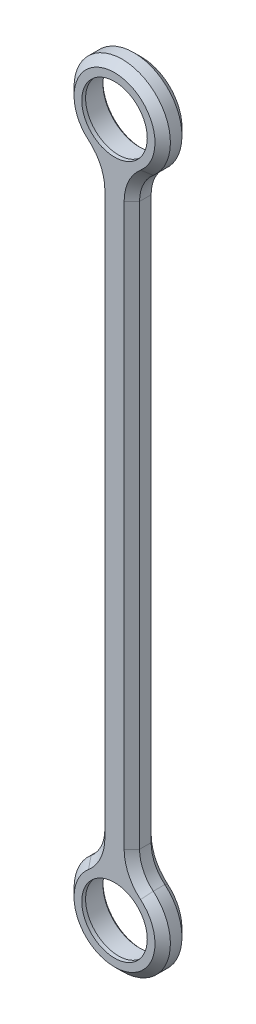
ISO-10303-21;
HEADER;
FILE_DESCRIPTION(('STEP AP214'),'2;1');
FILE_NAME('part.step','',(''),(''),'','','');
FILE_SCHEMA(('AUTOMOTIVE_DESIGN { 1 0 10303 214 1 1 1 1 }'));
ENDSEC;
DATA;
#1=APPLICATION_CONTEXT('core data for automotive mechanical design processes');
#2=APPLICATION_PROTOCOL_DEFINITION('international standard','automotive_design',2000,#1);
#3=PRODUCT_CONTEXT('',#1,'mechanical');
#4=PRODUCT('Part','Part','',(#3));
#5=PRODUCT_RELATED_PRODUCT_CATEGORY('part','',(#4));
#6=PRODUCT_DEFINITION_FORMATION('','',#4);
#7=PRODUCT_DEFINITION_CONTEXT('part definition',#1,'design');
#8=PRODUCT_DEFINITION('design','',#6,#7);
#9=PRODUCT_DEFINITION_SHAPE('','',#8);
#10=(LENGTH_UNIT() NAMED_UNIT(*) SI_UNIT(.MILLI.,.METRE.));
#11=(NAMED_UNIT(*) PLANE_ANGLE_UNIT() SI_UNIT($,.RADIAN.));
#12=(NAMED_UNIT(*) SI_UNIT($,.STERADIAN.) SOLID_ANGLE_UNIT());
#13=UNCERTAINTY_MEASURE_WITH_UNIT(LENGTH_MEASURE(1.E-05),#10,'distance_accuracy_value','');
#14=(GEOMETRIC_REPRESENTATION_CONTEXT(3) GLOBAL_UNCERTAINTY_ASSIGNED_CONTEXT((#13)) GLOBAL_UNIT_ASSIGNED_CONTEXT((#10,
#11,#12)) REPRESENTATION_CONTEXT('',''));
#15=CARTESIAN_POINT('',(0.,0.,0.));
#16=DIRECTION('',(0.,0.,1.));
#17=DIRECTION('',(1.,0.,0.));
#18=AXIS2_PLACEMENT_3D('',#15,#16,#17);
#19=CARTESIAN_POINT('',(44.5,-198.919368030824,-215.018764280739));
#20=DIRECTION('',(-1.,0.,0.));
#21=DIRECTION('',(0.,-1.,0.));
#22=AXIS2_PLACEMENT_3D('',#19,#20,#21);
#23=PLANE('',#22);
#24=DIRECTION('',(0.,0.,-1.));
#25=VECTOR('',#24,1.);
#26=CARTESIAN_POINT('',(44.5,-45.204650534086,-2.50000000010994));
#27=LINE('',#26,#25);
#28=CARTESIAN_POINT('',(44.5,-45.204650534086,-6.50000000010979));
#29=VERTEX_POINT('',#28);
#30=CARTESIAN_POINT('',(44.5,-45.204650534086,-3.5000000001108));
#31=VERTEX_POINT('',#30);
#32=EDGE_CURVE('E393',#29,#31,#27,.F.);
#33=ORIENTED_EDGE('',*,*,#32,.T.);
#34=DIRECTION('',(0.,-1.,0.));
#35=VECTOR('',#34,1.);
#36=CARTESIAN_POINT('',(44.5,-190.795349465914,-3.5000000001108));
#37=LINE('',#36,#35);
#38=CARTESIAN_POINT('',(44.5,-190.795349465914,-3.5000000001108));
#39=VERTEX_POINT('',#38);
#40=EDGE_CURVE('E295',#31,#39,#37,.T.);
#41=ORIENTED_EDGE('',*,*,#40,.T.);
#42=DIRECTION('',(0.,0.,-1.));
#43=VECTOR('',#42,1.);
#44=CARTESIAN_POINT('',(44.5,-190.795349465914,-8.50000000010665));
#45=LINE('',#44,#43);
#46=CARTESIAN_POINT('',(44.5,-190.795349465914,-6.50000000010673));
#47=VERTEX_POINT('',#46);
#48=EDGE_CURVE('E198',#39,#47,#45,.T.);
#49=ORIENTED_EDGE('',*,*,#48,.T.);
#50=DIRECTION('',(0.,1.,0.));
#51=VECTOR('',#50,1.);
#52=CARTESIAN_POINT('',(44.5,-198.919368030819,-6.50000000010656));
#53=LINE('',#52,#51);
#54=EDGE_CURVE('E242',#47,#29,#53,.T.);
#55=ORIENTED_EDGE('',*,*,#54,.T.);
#56=EDGE_LOOP('',(#33,#41,#49,#55));
#57=FACE_BOUND('',#56,.T.);
#58=ADVANCED_FACE('F40',(#57),#23,.F.);
#59=CARTESIAN_POINT('',(40.,-207.999999999999,-215.018764280738));
#60=DIRECTION('',(0.,0.,1.));
#61=DIRECTION('',(1.,0.,0.));
#62=AXIS2_PLACEMENT_3D('',#59,#60,#61);
#63=CYLINDRICAL_SURFACE('',#62,12.5);
#64=DIRECTION('',(0.,0.,1.));
#65=VECTOR('',#64,1.);
#66=CARTESIAN_POINT('',(48.0555555555556,-198.441860814396,-215.018764280738));
#67=LINE('',#66,#65);
#68=CARTESIAN_POINT('',(48.0555555555556,-198.441860814396,-6.50000000010673));
#69=VERTEX_POINT('',#68);
#70=CARTESIAN_POINT('',(48.0555555555556,-198.441860814396,-3.5000000001108));
#71=VERTEX_POINT('',#70);
#72=EDGE_CURVE('E384',#69,#71,#67,.T.);
#73=ORIENTED_EDGE('',*,*,#72,.T.);
#74=CARTESIAN_POINT('',(40.,-207.999999999999,-3.5000000001108));
#75=DIRECTION('',(0.,0.,1.));
#76=DIRECTION('',(1.,0.,0.));
#77=AXIS2_PLACEMENT_3D('',#74,#75,#76);
#78=CIRCLE('',#77,12.5);
#79=CARTESIAN_POINT('',(31.9444444444445,-198.441860814396,-3.5000000001108));
#80=VERTEX_POINT('',#79);
#81=EDGE_CURVE('E308',#71,#80,#78,.F.);
#82=ORIENTED_EDGE('',*,*,#81,.T.);
#83=DIRECTION('',(0.,0.,1.));
#84=VECTOR('',#83,1.);
#85=CARTESIAN_POINT('',(31.9444444444445,-198.441860814396,-215.018764280738));
#86=LINE('',#85,#84);
#87=CARTESIAN_POINT('',(31.9444444444445,-198.441860814396,-6.50000000010631));
#88=VERTEX_POINT('',#87);
#89=EDGE_CURVE('E386',#80,#88,#86,.F.);
#90=ORIENTED_EDGE('',*,*,#89,.T.);
#91=CARTESIAN_POINT('',(40.,-207.999999999999,-6.50000000010631));
#92=DIRECTION('',(0.,0.,1.));
#93=DIRECTION('',(1.,0.,0.));
#94=AXIS2_PLACEMENT_3D('',#91,#92,#93);
#95=CIRCLE('',#94,12.5);
#96=EDGE_CURVE('E228',#88,#69,#95,.T.);
#97=ORIENTED_EDGE('',*,*,#96,.T.);
#98=EDGE_LOOP('',(#73,#82,#90,#97));
#99=FACE_BOUND('',#98,.T.);
#100=ADVANCED_FACE('F383',(#99),#63,.T.);
#101=CARTESIAN_POINT('',(35.5,-198.919368030824,-215.018764280739));
#102=DIRECTION('',(1.,0.,0.));
#103=DIRECTION('',(0.,1.,0.));
#104=AXIS2_PLACEMENT_3D('',#101,#102,#103);
#105=PLANE('',#104);
#106=DIRECTION('',(0.,0.,-1.));
#107=VECTOR('',#106,1.);
#108=CARTESIAN_POINT('',(35.5,-190.795349465914,-2.50000000010664));
#109=LINE('',#108,#107);
#110=CARTESIAN_POINT('',(35.5,-190.795349465914,-6.5000000001067));
#111=VERTEX_POINT('',#110);
#112=CARTESIAN_POINT('',(35.5,-190.795349465914,-3.5000000001108));
#113=VERTEX_POINT('',#112);
#114=EDGE_CURVE('E182',#111,#113,#109,.F.);
#115=ORIENTED_EDGE('',*,*,#114,.T.);
#116=DIRECTION('',(0.,1.,0.));
#117=VECTOR('',#116,1.);
#118=CARTESIAN_POINT('',(35.5,-45.2046505340861,-3.5000000001108));
#119=LINE('',#118,#117);
#120=CARTESIAN_POINT('',(35.5,-45.2046505340861,-3.5000000001108));
#121=VERTEX_POINT('',#120);
#122=EDGE_CURVE('E64',#113,#121,#119,.T.);
#123=ORIENTED_EDGE('',*,*,#122,.T.);
#124=DIRECTION('',(0.,0.,-1.));
#125=VECTOR('',#124,1.);
#126=CARTESIAN_POINT('',(35.5,-45.2046505340861,-8.50000000010995));
#127=LINE('',#126,#125);
#128=CARTESIAN_POINT('',(35.5,-45.2046505340861,-6.50000000010981));
#129=VERTEX_POINT('',#128);
#130=EDGE_CURVE('E183',#121,#129,#127,.T.);
#131=ORIENTED_EDGE('',*,*,#130,.T.);
#132=DIRECTION('',(0.,-1.,0.));
#133=VECTOR('',#132,1.);
#134=CARTESIAN_POINT('',(35.5,-198.919368030819,-6.50000000010656));
#135=LINE('',#134,#133);
#136=EDGE_CURVE('E162',#129,#111,#135,.T.);
#137=ORIENTED_EDGE('',*,*,#136,.T.);
#138=EDGE_LOOP('',(#115,#123,#131,#137));
#139=FACE_BOUND('',#138,.T.);
#140=ADVANCED_FACE('F181',(#139),#105,.F.);
#141=CARTESIAN_POINT('',(40.,-28.0000000000008,-215.018764280742));
#142=DIRECTION('',(0.,0.,1.));
#143=DIRECTION('',(1.,0.,0.));
#144=AXIS2_PLACEMENT_3D('',#141,#142,#143);
#145=CYLINDRICAL_SURFACE('',#144,12.5);
#146=DIRECTION('',(0.,0.,1.));
#147=VECTOR('',#146,1.);
#148=CARTESIAN_POINT('',(31.9444444444445,-37.5581391856037,-215.018764280742));
#149=LINE('',#148,#147);
#150=CARTESIAN_POINT('',(31.9444444444445,-37.5581391856037,-6.5000000001102));
#151=VERTEX_POINT('',#150);
#152=CARTESIAN_POINT('',(31.9444444444445,-37.5581391856037,-3.5000000001108));
#153=VERTEX_POINT('',#152);
#154=EDGE_CURVE('E187',#151,#153,#149,.T.);
#155=ORIENTED_EDGE('',*,*,#154,.T.);
#156=CARTESIAN_POINT('',(40.,-28.0000000000008,-3.5000000001108));
#157=DIRECTION('',(0.,0.,1.));
#158=DIRECTION('',(1.,0.,0.));
#159=AXIS2_PLACEMENT_3D('',#156,#157,#158);
#160=CIRCLE('',#159,12.5);
#161=CARTESIAN_POINT('',(48.0555555555556,-37.5581391856037,-3.5000000001108));
#162=VERTEX_POINT('',#161);
#163=EDGE_CURVE('E305',#153,#162,#160,.F.);
#164=ORIENTED_EDGE('',*,*,#163,.T.);
#165=DIRECTION('',(0.,0.,1.));
#166=VECTOR('',#165,1.);
#167=CARTESIAN_POINT('',(48.0555555555556,-37.5581391856037,-215.018764280742));
#168=LINE('',#167,#166);
#169=CARTESIAN_POINT('',(48.0555555555556,-37.5581391856037,-6.50000000010983));
#170=VERTEX_POINT('',#169);
#171=EDGE_CURVE('E191',#162,#170,#168,.F.);
#172=ORIENTED_EDGE('',*,*,#171,.T.);
#173=CARTESIAN_POINT('',(40.,-28.0000000000008,-6.5000000001102));
#174=DIRECTION('',(0.,0.,1.));
#175=DIRECTION('',(1.,0.,0.));
#176=AXIS2_PLACEMENT_3D('',#173,#174,#175);
#177=CIRCLE('',#176,12.5);
#178=EDGE_CURVE('E231',#170,#151,#177,.T.);
#179=ORIENTED_EDGE('',*,*,#178,.T.);
#180=EDGE_LOOP('',(#155,#164,#172,#179));
#181=FACE_BOUND('',#180,.T.);
#182=ADVANCED_FACE('F470',(#181),#145,.T.);
#183=CARTESIAN_POINT('',(40.,-28.0000000000008,-215.018764280742));
#184=DIRECTION('',(0.,0.,1.));
#185=DIRECTION('',(1.,0.,0.));
#186=AXIS2_PLACEMENT_3D('',#183,#184,#185);
#187=CYLINDRICAL_SURFACE('',#186,9.50000000000059);
#188=CARTESIAN_POINT('',(40.,-28.0000000000008,-8.00000000011022));
#189=DIRECTION('',(0.,0.,1.));
#190=DIRECTION('',(1.,0.,0.));
#191=AXIS2_PLACEMENT_3D('',#188,#189,#190);
#192=CIRCLE('',#191,9.50000000000059);
#193=CARTESIAN_POINT('',(49.5000000000006,-28.0000000000008,-8.00000000011022));
#194=VERTEX_POINT('',#193);
#195=EDGE_CURVE('E11',#194,#194,#192,.F.);
#196=ORIENTED_EDGE('',*,*,#195,.T.);
#197=EDGE_LOOP('',(#196));
#198=FACE_BOUND('',#197,.T.);
#199=CARTESIAN_POINT('',(40.,-28.0000000000008,-2.50000000011018));
#200=DIRECTION('',(0.,0.,-1.));
#201=DIRECTION('',(0.,1.,0.));
#202=AXIS2_PLACEMENT_3D('',#199,#200,#201);
#203=CIRCLE('',#202,9.50000000000059);
#204=CARTESIAN_POINT('',(40.,-18.5000000000002,-2.50000000011039));
#205=VERTEX_POINT('',#204);
#206=EDGE_CURVE('E270',#205,#205,#203,.T.);
#207=ORIENTED_EDGE('',*,*,#206,.F.);
#208=EDGE_LOOP('',(#207));
#209=FACE_BOUND('',#208,.T.);
#210=ADVANCED_FACE('F467',(#198,#209),#187,.F.);
#211=CARTESIAN_POINT('',(40.,-207.999999999999,-215.018764280738));
#212=DIRECTION('',(0.,0.,1.));
#213=DIRECTION('',(1.,0.,0.));
#214=AXIS2_PLACEMENT_3D('',#211,#212,#213);
#215=CYLINDRICAL_SURFACE('',#214,9.50000000000001);
#216=CARTESIAN_POINT('',(40.,-207.999999999999,-8.00000000010637));
#217=DIRECTION('',(0.,0.,1.));
#218=DIRECTION('',(1.,0.,0.));
#219=AXIS2_PLACEMENT_3D('',#216,#217,#218);
#220=CIRCLE('',#219,9.50000000000001);
#221=CARTESIAN_POINT('',(49.5,-207.999999999999,-8.00000000010637));
#222=VERTEX_POINT('',#221);
#223=EDGE_CURVE('E50',#222,#222,#220,.F.);
#224=ORIENTED_EDGE('',*,*,#223,.T.);
#225=EDGE_LOOP('',(#224));
#226=FACE_BOUND('',#225,.T.);
#227=CARTESIAN_POINT('',(40.,-207.999999999999,-2.5000000001064));
#228=DIRECTION('',(0.,0.,-1.));
#229=DIRECTION('',(0.,1.,0.));
#230=AXIS2_PLACEMENT_3D('',#227,#228,#229);
#231=CIRCLE('',#230,9.50000000000001);
#232=CARTESIAN_POINT('',(40.,-198.499999999999,-2.5000000001066));
#233=VERTEX_POINT('',#232);
#234=EDGE_CURVE('E418',#233,#233,#231,.T.);
#235=ORIENTED_EDGE('',*,*,#234,.F.);
#236=EDGE_LOOP('',(#235));
#237=FACE_BOUND('',#236,.T.);
#238=ADVANCED_FACE('F359',(#226,#237),#215,.F.);
#239=CARTESIAN_POINT('',(38.8190301982066,-200.740357248379,-8.50000000010655));
#240=DIRECTION('',(0.,0.,1.));
#241=DIRECTION('',(-0.160565335137281,0.987025214040783,0.));
#242=AXIS2_PLACEMENT_3D('',#239,#240,#241);
#243=PLANE('',#242);
#244=CARTESIAN_POINT('',(40.,-207.999999999999,-8.5000000001064));
#245=DIRECTION('',(0.,0.,1.));
#246=DIRECTION('',(0.,-1.,0.));
#247=AXIS2_PLACEMENT_3D('',#244,#245,#246);
#248=CIRCLE('',#247,9.99999999999984);
#249=CARTESIAN_POINT('',(40.,-217.999999999999,-8.50000000010619));
#250=VERTEX_POINT('',#249);
#251=EDGE_CURVE('E352',#250,#250,#248,.T.);
#252=ORIENTED_EDGE('',*,*,#251,.T.);
#253=EDGE_LOOP('',(#252));
#254=FACE_BOUND('',#253,.T.);
#255=CARTESIAN_POINT('',(40.,-28.0000000000008,-8.50000000011019));
#256=DIRECTION('',(0.,0.,1.));
#257=DIRECTION('',(0.,-1.,0.));
#258=AXIS2_PLACEMENT_3D('',#255,#256,#257);
#259=CIRCLE('',#258,10.0000000000003);
#260=CARTESIAN_POINT('',(40.,-38.0000000000011,-8.50000000010997));
#261=VERTEX_POINT('',#260);
#262=EDGE_CURVE('E318',#261,#261,#259,.T.);
#263=ORIENTED_EDGE('',*,*,#262,.T.);
#264=EDGE_LOOP('',(#263));
#265=FACE_BOUND('',#264,.T.);
#266=CARTESIAN_POINT('',(25.5,-190.795349465914,-8.50000000010676));
#267=DIRECTION('',(0.,0.,1.));
#268=DIRECTION('',(0.,-1.,0.));
#269=AXIS2_PLACEMENT_3D('',#266,#267,#268);
#270=CIRCLE('',#269,12.);
#271=CARTESIAN_POINT('',(33.2333333333335,-199.971163084093,-8.50000000010657));
#272=VERTEX_POINT('',#271);
#273=CARTESIAN_POINT('',(37.5,-190.795349465914,-8.50000000010676));
#274=VERTEX_POINT('',#273);
#275=EDGE_CURVE('E221',#272,#274,#270,.T.);
#276=ORIENTED_EDGE('',*,*,#275,.T.);
#277=DIRECTION('',(0.,1.,0.));
#278=VECTOR('',#277,1.);
#279=CARTESIAN_POINT('',(37.5,-200.740357248379,-8.50000000010655));
#280=LINE('',#279,#278);
#281=CARTESIAN_POINT('',(37.5000000000002,-45.2046505340861,-8.50000000010983));
#282=VERTEX_POINT('',#281);
#283=EDGE_CURVE('E164',#274,#282,#280,.T.);
#284=ORIENTED_EDGE('',*,*,#283,.T.);
#285=CARTESIAN_POINT('',(25.5,-45.2046505340861,-8.50000000010983));
#286=DIRECTION('',(0.,0.,1.));
#287=DIRECTION('',(0.,-1.,0.));
#288=AXIS2_PLACEMENT_3D('',#285,#286,#287);
#289=CIRCLE('',#288,12.0000000000002);
#290=CARTESIAN_POINT('',(33.2333333333332,-36.0288369159074,-8.50000000011002));
#291=VERTEX_POINT('',#290);
#292=EDGE_CURVE('E218',#282,#291,#289,.T.);
#293=ORIENTED_EDGE('',*,*,#292,.T.);
#294=CARTESIAN_POINT('',(40.,-28.0000000000008,-8.50000000011019));
#295=DIRECTION('',(0.,0.,1.));
#296=DIRECTION('',(0.,-1.,0.));
#297=AXIS2_PLACEMENT_3D('',#294,#295,#296);
#298=CIRCLE('',#297,10.5000000000002);
#299=CARTESIAN_POINT('',(46.7666666666667,-36.0288369159073,-8.50000000011002));
#300=VERTEX_POINT('',#299);
#301=EDGE_CURVE('E212',#291,#300,#298,.F.);
#302=ORIENTED_EDGE('',*,*,#301,.T.);
#303=CARTESIAN_POINT('',(54.5,-45.204650534086,-8.50000000010982));
#304=DIRECTION('',(0.,0.,1.));
#305=DIRECTION('',(0.,-1.,0.));
#306=AXIS2_PLACEMENT_3D('',#303,#304,#305);
#307=CIRCLE('',#306,12.);
#308=CARTESIAN_POINT('',(42.5,-45.2046505340861,-8.50000000010982));
#309=VERTEX_POINT('',#308);
#310=EDGE_CURVE('E207',#300,#309,#307,.T.);
#311=ORIENTED_EDGE('',*,*,#310,.T.);
#312=DIRECTION('',(0.,-1.,0.));
#313=VECTOR('',#312,1.);
#314=CARTESIAN_POINT('',(42.5,-200.740357248379,-8.50000000010655));
#315=LINE('',#314,#313);
#316=CARTESIAN_POINT('',(42.5,-190.795349465914,-8.50000000010676));
#317=VERTEX_POINT('',#316);
#318=EDGE_CURVE('E186',#309,#317,#315,.T.);
#319=ORIENTED_EDGE('',*,*,#318,.T.);
#320=CARTESIAN_POINT('',(54.5,-190.795349465914,-8.50000000010676));
#321=DIRECTION('',(0.,0.,1.));
#322=DIRECTION('',(0.,-1.,0.));
#323=AXIS2_PLACEMENT_3D('',#320,#321,#322);
#324=CIRCLE('',#323,11.9999999999998);
#325=CARTESIAN_POINT('',(46.7666666666668,-199.971163084092,-8.50000000010657));
#326=VERTEX_POINT('',#325);
#327=EDGE_CURVE('E209',#317,#326,#324,.T.);
#328=ORIENTED_EDGE('',*,*,#327,.T.);
#329=CARTESIAN_POINT('',(40.,-207.999999999999,-8.5000000001064));
#330=DIRECTION('',(0.,0.,1.));
#331=DIRECTION('',(0.,-1.,0.));
#332=AXIS2_PLACEMENT_3D('',#329,#330,#331);
#333=CIRCLE('',#332,10.4999999999998);
#334=EDGE_CURVE('E215',#326,#272,#333,.F.);
#335=ORIENTED_EDGE('',*,*,#334,.T.);
#336=EDGE_LOOP('',(#276,#284,#293,#302,#311,#319,#328,#335));
#337=FACE_BOUND('',#336,.T.);
#338=ADVANCED_FACE('F368',(#254,#265,#337),#243,.F.);
#339=CARTESIAN_POINT('',(54.5,-190.795349465914,-215.018764280738));
#340=DIRECTION('',(0.,0.,1.));
#341=DIRECTION('',(1.,0.,0.));
#342=AXIS2_PLACEMENT_3D('',#339,#340,#341);
#343=CYLINDRICAL_SURFACE('',#342,10.);
#344=ORIENTED_EDGE('',*,*,#48,.F.);
#345=CARTESIAN_POINT('',(54.5,-190.795349465914,-3.5000000001108));
#346=DIRECTION('',(0.,0.,1.));
#347=DIRECTION('',(1.,0.,0.));
#348=AXIS2_PLACEMENT_3D('',#345,#346,#347);
#349=CIRCLE('',#348,10.);
#350=EDGE_CURVE('E302',#39,#71,#349,.T.);
#351=ORIENTED_EDGE('',*,*,#350,.T.);
#352=ORIENTED_EDGE('',*,*,#72,.F.);
#353=CARTESIAN_POINT('',(54.5,-190.795349465914,-6.50000000010673));
#354=DIRECTION('',(0.,0.,1.));
#355=DIRECTION('',(1.,0.,0.));
#356=AXIS2_PLACEMENT_3D('',#353,#354,#355);
#357=CIRCLE('',#356,10.);
#358=EDGE_CURVE('E234',#69,#47,#357,.F.);
#359=ORIENTED_EDGE('',*,*,#358,.T.);
#360=EDGE_LOOP('',(#344,#351,#352,#359));
#361=FACE_BOUND('',#360,.T.);
#362=ADVANCED_FACE('F371',(#361),#343,.F.);
#363=CARTESIAN_POINT('',(25.5,-190.795349465914,-215.018764280738));
#364=DIRECTION('',(0.,0.,1.));
#365=DIRECTION('',(1.,0.,0.));
#366=AXIS2_PLACEMENT_3D('',#363,#364,#365);
#367=CYLINDRICAL_SURFACE('',#366,10.);
#368=ORIENTED_EDGE('',*,*,#89,.F.);
#369=CARTESIAN_POINT('',(25.5,-190.795349465914,-3.5000000001108));
#370=DIRECTION('',(0.,0.,1.));
#371=DIRECTION('',(1.,0.,0.));
#372=AXIS2_PLACEMENT_3D('',#369,#370,#371);
#373=CIRCLE('',#372,10.);
#374=EDGE_CURVE('E57',#80,#113,#373,.T.);
#375=ORIENTED_EDGE('',*,*,#374,.T.);
#376=ORIENTED_EDGE('',*,*,#114,.F.);
#377=CARTESIAN_POINT('',(25.5,-190.795349465914,-6.5000000001067));
#378=DIRECTION('',(0.,0.,1.));
#379=DIRECTION('',(1.,0.,0.));
#380=AXIS2_PLACEMENT_3D('',#377,#378,#379);
#381=CIRCLE('',#380,10.);
#382=EDGE_CURVE('E173',#111,#88,#381,.F.);
#383=ORIENTED_EDGE('',*,*,#382,.T.);
#384=EDGE_LOOP('',(#368,#375,#376,#383));
#385=FACE_BOUND('',#384,.T.);
#386=ADVANCED_FACE('F189',(#385),#367,.F.);
#387=CARTESIAN_POINT('',(25.5,-45.2046505340861,-215.018764280742));
#388=DIRECTION('',(0.,0.,1.));
#389=DIRECTION('',(1.,0.,0.));
#390=AXIS2_PLACEMENT_3D('',#387,#388,#389);
#391=CYLINDRICAL_SURFACE('',#390,10.);
#392=ORIENTED_EDGE('',*,*,#130,.F.);
#393=CARTESIAN_POINT('',(25.5,-45.2046505340861,-3.5000000001108));
#394=DIRECTION('',(0.,0.,1.));
#395=DIRECTION('',(1.,0.,0.));
#396=AXIS2_PLACEMENT_3D('',#393,#394,#395);
#397=CIRCLE('',#396,10.);
#398=EDGE_CURVE('E311',#121,#153,#397,.T.);
#399=ORIENTED_EDGE('',*,*,#398,.T.);
#400=ORIENTED_EDGE('',*,*,#154,.F.);
#401=CARTESIAN_POINT('',(25.5,-45.2046505340861,-6.50000000010981));
#402=DIRECTION('',(0.,0.,1.));
#403=DIRECTION('',(1.,0.,0.));
#404=AXIS2_PLACEMENT_3D('',#401,#402,#403);
#405=CIRCLE('',#404,10.);
#406=EDGE_CURVE('E179',#151,#129,#405,.F.);
#407=ORIENTED_EDGE('',*,*,#406,.T.);
#408=EDGE_LOOP('',(#392,#399,#400,#407));
#409=FACE_BOUND('',#408,.T.);
#410=ADVANCED_FACE('F478',(#409),#391,.F.);
#411=CARTESIAN_POINT('',(54.5,-45.204650534086,-215.018764280742));
#412=DIRECTION('',(0.,0.,1.));
#413=DIRECTION('',(1.,0.,0.));
#414=AXIS2_PLACEMENT_3D('',#411,#412,#413);
#415=CYLINDRICAL_SURFACE('',#414,10.);
#416=ORIENTED_EDGE('',*,*,#171,.F.);
#417=CARTESIAN_POINT('',(54.5,-45.204650534086,-3.5000000001108));
#418=DIRECTION('',(0.,0.,1.));
#419=DIRECTION('',(1.,0.,0.));
#420=AXIS2_PLACEMENT_3D('',#417,#418,#419);
#421=CIRCLE('',#420,10.);
#422=EDGE_CURVE('E299',#162,#31,#421,.T.);
#423=ORIENTED_EDGE('',*,*,#422,.T.);
#424=ORIENTED_EDGE('',*,*,#32,.F.);
#425=CARTESIAN_POINT('',(54.5,-45.204650534086,-6.50000000010983));
#426=DIRECTION('',(0.,0.,1.));
#427=DIRECTION('',(1.,0.,0.));
#428=AXIS2_PLACEMENT_3D('',#425,#426,#427);
#429=CIRCLE('',#428,10.);
#430=EDGE_CURVE('E238',#29,#170,#429,.F.);
#431=ORIENTED_EDGE('',*,*,#430,.T.);
#432=EDGE_LOOP('',(#416,#423,#424,#431));
#433=FACE_BOUND('',#432,.T.);
#434=ADVANCED_FACE('F409',(#433),#415,.F.);
#435=CARTESIAN_POINT('',(44.5,-198.919368030819,-6.50000000010656));
#436=DIRECTION('',(-0.707106781186552,0.,0.707106781186543));
#437=DIRECTION('',(0.,1.,0.));
#438=AXIS2_PLACEMENT_3D('',#435,#436,#437);
#439=PLANE('',#438);
#440=DIRECTION('',(0.707106781186543,0.,0.707106781186552));
#441=VECTOR('',#440,1.);
#442=CARTESIAN_POINT('',(42.5,-190.795349465914,-8.50000000010676));
#443=LINE('',#442,#441);
#444=EDGE_CURVE('E262',#317,#47,#443,.T.);
#445=ORIENTED_EDGE('',*,*,#444,.F.);
#446=ORIENTED_EDGE('',*,*,#318,.F.);
#447=DIRECTION('',(-0.707106781186543,0.,-0.707106781186552));
#448=VECTOR('',#447,1.);
#449=CARTESIAN_POINT('',(44.5,-45.204650534086,-6.50000000010979));
#450=LINE('',#449,#448);
#451=EDGE_CURVE('E266',#29,#309,#450,.T.);
#452=ORIENTED_EDGE('',*,*,#451,.F.);
#453=ORIENTED_EDGE('',*,*,#54,.F.);
#454=EDGE_LOOP('',(#445,#446,#452,#453));
#455=FACE_BOUND('',#454,.T.);
#456=ADVANCED_FACE('F400',(#455),#439,.F.);
#457=CARTESIAN_POINT('',(54.5,-45.204650534086,-8.50000000010984));
#458=DIRECTION('',(0.,0.,-1.));
#459=DIRECTION('',(-1.,0.,0.));
#460=AXIS2_PLACEMENT_3D('',#457,#458,#459);
#461=CONICAL_SURFACE('',#460,12.,0.785398163397441);
#462=ORIENTED_EDGE('',*,*,#451,.T.);
#463=ORIENTED_EDGE('',*,*,#310,.F.);
#464=DIRECTION('',(-0.455691036764644,0.540690002693139,-0.707106781186588));
#465=VECTOR('',#464,1.);
#466=CARTESIAN_POINT('',(48.0555555555556,-37.5581391856037,-6.50000000010983));
#467=LINE('',#466,#465);
#468=EDGE_CURVE('E258',#170,#300,#467,.T.);
#469=ORIENTED_EDGE('',*,*,#468,.F.);
#470=ORIENTED_EDGE('',*,*,#430,.F.);
#471=EDGE_LOOP('',(#462,#463,#469,#470));
#472=FACE_BOUND('',#471,.T.);
#473=ADVANCED_FACE('F520',(#472),#461,.F.);
#474=CARTESIAN_POINT('',(54.5,-190.795349465914,-8.50000000010676));
#475=DIRECTION('',(0.,0.,-1.));
#476=DIRECTION('',(-1.,0.,0.));
#477=AXIS2_PLACEMENT_3D('',#474,#475,#476);
#478=CONICAL_SURFACE('',#477,12.,0.785398163397442);
#479=ORIENTED_EDGE('',*,*,#444,.T.);
#480=ORIENTED_EDGE('',*,*,#358,.F.);
#481=DIRECTION('',(0.455691036764651,0.540690002693183,0.70710678118655));
#482=VECTOR('',#481,1.);
#483=CARTESIAN_POINT('',(46.7666666666668,-199.971163084092,-8.50000000010657));
#484=LINE('',#483,#482);
#485=EDGE_CURVE('E254',#326,#69,#484,.T.);
#486=ORIENTED_EDGE('',*,*,#485,.F.);
#487=ORIENTED_EDGE('',*,*,#327,.F.);
#488=EDGE_LOOP('',(#479,#480,#486,#487));
#489=FACE_BOUND('',#488,.T.);
#490=ADVANCED_FACE('F396',(#489),#478,.F.);
#491=CARTESIAN_POINT('',(40.,-28.0000000000008,-6.5000000001102));
#492=DIRECTION('',(0.,0.,1.));
#493=DIRECTION('',(1.,0.,0.));
#494=AXIS2_PLACEMENT_3D('',#491,#492,#493);
#495=CONICAL_SURFACE('',#494,12.5,0.785398163397441);
#496=ORIENTED_EDGE('',*,*,#468,.T.);
#497=ORIENTED_EDGE('',*,*,#301,.F.);
#498=DIRECTION('',(0.455691036764666,0.540690002693167,-0.707106781186553));
#499=VECTOR('',#498,1.);
#500=CARTESIAN_POINT('',(31.9444444444445,-37.5581391856037,-6.5000000001102));
#501=LINE('',#500,#499);
#502=EDGE_CURVE('E250',#151,#291,#501,.T.);
#503=ORIENTED_EDGE('',*,*,#502,.F.);
#504=ORIENTED_EDGE('',*,*,#178,.F.);
#505=EDGE_LOOP('',(#496,#497,#503,#504));
#506=FACE_BOUND('',#505,.T.);
#507=ADVANCED_FACE('F508',(#506),#495,.T.);
#508=CARTESIAN_POINT('',(40.,-207.999999999999,-6.50000000010631));
#509=DIRECTION('',(0.,0.,1.));
#510=DIRECTION('',(1.,0.,0.));
#511=AXIS2_PLACEMENT_3D('',#508,#509,#510);
#512=CONICAL_SURFACE('',#511,12.5,0.785398163397439);
#513=ORIENTED_EDGE('',*,*,#485,.T.);
#514=ORIENTED_EDGE('',*,*,#96,.F.);
#515=DIRECTION('',(-0.45569103676465,0.540690002693179,0.707106781186553));
#516=VECTOR('',#515,1.);
#517=CARTESIAN_POINT('',(33.2333333333335,-199.971163084093,-8.50000000010657));
#518=LINE('',#517,#516);
#519=EDGE_CURVE('E176',#272,#88,#518,.T.);
#520=ORIENTED_EDGE('',*,*,#519,.F.);
#521=ORIENTED_EDGE('',*,*,#334,.F.);
#522=EDGE_LOOP('',(#513,#514,#520,#521));
#523=FACE_BOUND('',#522,.T.);
#524=ADVANCED_FACE('F379',(#523),#512,.T.);
#525=CARTESIAN_POINT('',(25.5,-45.2046505340861,-8.50000000010984));
#526=DIRECTION('',(0.,0.,-1.));
#527=DIRECTION('',(-1.,0.,0.));
#528=AXIS2_PLACEMENT_3D('',#525,#526,#527);
#529=CONICAL_SURFACE('',#528,12.,0.785398163397441);
#530=ORIENTED_EDGE('',*,*,#502,.T.);
#531=ORIENTED_EDGE('',*,*,#292,.F.);
#532=DIRECTION('',(0.707106781186578,0.,-0.707106781186517));
#533=VECTOR('',#532,1.);
#534=CARTESIAN_POINT('',(35.5,-45.2046505340861,-6.50000000010981));
#535=LINE('',#534,#533);
#536=EDGE_CURVE('E168',#129,#282,#535,.T.);
#537=ORIENTED_EDGE('',*,*,#536,.F.);
#538=ORIENTED_EDGE('',*,*,#406,.F.);
#539=EDGE_LOOP('',(#530,#531,#537,#538));
#540=FACE_BOUND('',#539,.T.);
#541=ADVANCED_FACE('F496',(#540),#529,.F.);
#542=CARTESIAN_POINT('',(25.5,-190.795349465914,-8.50000000010678));
#543=DIRECTION('',(0.,0.,-1.));
#544=DIRECTION('',(-1.,0.,0.));
#545=AXIS2_PLACEMENT_3D('',#542,#543,#544);
#546=CONICAL_SURFACE('',#545,12.,0.785398163397435);
#547=ORIENTED_EDGE('',*,*,#519,.T.);
#548=ORIENTED_EDGE('',*,*,#382,.F.);
#549=DIRECTION('',(-0.707106781186538,0.,0.707106781186557));
#550=VECTOR('',#549,1.);
#551=CARTESIAN_POINT('',(37.5,-190.795349465914,-8.50000000010676));
#552=LINE('',#551,#550);
#553=EDGE_CURVE('E158',#274,#111,#552,.T.);
#554=ORIENTED_EDGE('',*,*,#553,.F.);
#555=ORIENTED_EDGE('',*,*,#275,.F.);
#556=EDGE_LOOP('',(#547,#548,#554,#555));
#557=FACE_BOUND('',#556,.T.);
#558=ADVANCED_FACE('F174',(#557),#546,.F.);
#559=CARTESIAN_POINT('',(35.5,-198.919368030819,-6.50000000010656));
#560=DIRECTION('',(0.707106781186553,0.,0.707106781186543));
#561=DIRECTION('',(0.,-1.,0.));
#562=AXIS2_PLACEMENT_3D('',#559,#560,#561);
#563=PLANE('',#562);
#564=ORIENTED_EDGE('',*,*,#536,.T.);
#565=ORIENTED_EDGE('',*,*,#283,.F.);
#566=ORIENTED_EDGE('',*,*,#553,.T.);
#567=ORIENTED_EDGE('',*,*,#136,.F.);
#568=EDGE_LOOP('',(#564,#565,#566,#567));
#569=FACE_BOUND('',#568,.T.);
#570=ADVANCED_FACE('F160',(#569),#563,.F.);
#571=CARTESIAN_POINT('',(54.5,-190.795349465914,-2.50000000011079));
#572=DIRECTION('',(0.,0.,1.));
#573=DIRECTION('',(1.,0.,0.));
#574=AXIS2_PLACEMENT_3D('',#571,#572,#573);
#575=PLANE('',#574);
#576=CARTESIAN_POINT('',(40.,-28.0000000000008,-2.50000000011079));
#577=DIRECTION('',(0.,0.,1.));
#578=DIRECTION('',(1.,0.,0.));
#579=AXIS2_PLACEMENT_3D('',#576,#577,#578);
#580=CIRCLE('',#579,8.5);
#581=CARTESIAN_POINT('',(48.5,-28.0000000000008,-2.50000000011079));
#582=VERTEX_POINT('',#581);
#583=EDGE_CURVE('E425',#582,#582,#580,.T.);
#584=ORIENTED_EDGE('',*,*,#583,.T.);
#585=EDGE_LOOP('',(#584));
#586=FACE_BOUND('',#585,.T.);
#587=ORIENTED_EDGE('',*,*,#206,.T.);
#588=EDGE_LOOP('',(#587));
#589=FACE_BOUND('',#588,.T.);
#590=ADVANCED_FACE('F455',(#586,#589),#575,.F.);
#591=CARTESIAN_POINT('',(40.,-207.999999999999,-2.50000000011079));
#592=DIRECTION('',(0.,0.,1.));
#593=DIRECTION('',(1.,0.,0.));
#594=AXIS2_PLACEMENT_3D('',#591,#592,#593);
#595=CIRCLE('',#594,8.50000000000001);
#596=CARTESIAN_POINT('',(48.5,-207.999999999999,-2.50000000011079));
#597=VERTEX_POINT('',#596);
#598=EDGE_CURVE('E348',#597,#597,#595,.T.);
#599=ORIENTED_EDGE('',*,*,#598,.T.);
#600=EDGE_LOOP('',(#599));
#601=FACE_BOUND('',#600,.T.);
#602=ORIENTED_EDGE('',*,*,#234,.T.);
#603=EDGE_LOOP('',(#602));
#604=FACE_BOUND('',#603,.T.);
#605=ADVANCED_FACE('F446',(#601,#604),#575,.F.);
#606=CARTESIAN_POINT('',(54.5,-190.795349465914,-1.50000000011079));
#607=DIRECTION('',(0.,0.,1.));
#608=DIRECTION('',(1.,0.,0.));
#609=AXIS2_PLACEMENT_3D('',#606,#607,#608);
#610=PLANE('',#609);
#611=CARTESIAN_POINT('',(54.5,-190.795349465914,-1.50000000011079));
#612=DIRECTION('',(0.,0.,1.));
#613=DIRECTION('',(1.,0.,0.));
#614=AXIS2_PLACEMENT_3D('',#611,#612,#613);
#615=CIRCLE('',#614,12.);
#616=CARTESIAN_POINT('',(46.7666666666667,-199.971163084093,-1.50000000011079));
#617=VERTEX_POINT('',#616);
#618=CARTESIAN_POINT('',(42.5,-190.795349465914,-1.50000000011079));
#619=VERTEX_POINT('',#618);
#620=EDGE_CURVE('E285',#617,#619,#615,.F.);
#621=ORIENTED_EDGE('',*,*,#620,.T.);
#622=DIRECTION('',(0.,1.,0.));
#623=VECTOR('',#622,1.);
#624=CARTESIAN_POINT('',(42.5,-45.204650534086,-1.50000000011079));
#625=LINE('',#624,#623);
#626=CARTESIAN_POINT('',(42.5,-45.204650534086,-1.50000000011079));
#627=VERTEX_POINT('',#626);
#628=EDGE_CURVE('E291',#619,#627,#625,.T.);
#629=ORIENTED_EDGE('',*,*,#628,.T.);
#630=CARTESIAN_POINT('',(54.5,-45.204650534086,-1.50000000011079));
#631=DIRECTION('',(0.,0.,1.));
#632=DIRECTION('',(1.,0.,0.));
#633=AXIS2_PLACEMENT_3D('',#630,#631,#632);
#634=CIRCLE('',#633,12.);
#635=CARTESIAN_POINT('',(46.7666666666667,-36.0288369159072,-1.50000000011079));
#636=VERTEX_POINT('',#635);
#637=EDGE_CURVE('E288',#627,#636,#634,.F.);
#638=ORIENTED_EDGE('',*,*,#637,.T.);
#639=CARTESIAN_POINT('',(40.,-28.0000000000008,-1.50000000011079));
#640=DIRECTION('',(0.,0.,1.));
#641=DIRECTION('',(1.,0.,0.));
#642=AXIS2_PLACEMENT_3D('',#639,#640,#641);
#643=CIRCLE('',#642,10.5);
#644=CARTESIAN_POINT('',(33.2333333333333,-36.0288369159072,-1.50000000011079));
#645=VERTEX_POINT('',#644);
#646=EDGE_CURVE('E282',#636,#645,#643,.T.);
#647=ORIENTED_EDGE('',*,*,#646,.T.);
#648=CARTESIAN_POINT('',(25.5,-45.2046505340861,-1.50000000011079));
#649=DIRECTION('',(0.,0.,1.));
#650=DIRECTION('',(1.,0.,0.));
#651=AXIS2_PLACEMENT_3D('',#648,#649,#650);
#652=CIRCLE('',#651,12.);
#653=CARTESIAN_POINT('',(37.5,-45.2046505340861,-1.50000000011079));
#654=VERTEX_POINT('',#653);
#655=EDGE_CURVE('E276',#645,#654,#652,.F.);
#656=ORIENTED_EDGE('',*,*,#655,.T.);
#657=DIRECTION('',(0.,-1.,0.));
#658=VECTOR('',#657,1.);
#659=CARTESIAN_POINT('',(37.5000000000001,-190.795349465914,-1.50000000011079));
#660=LINE('',#659,#658);
#661=CARTESIAN_POINT('',(37.5000000000001,-190.795349465914,-1.50000000011079));
#662=VERTEX_POINT('',#661);
#663=EDGE_CURVE('E244',#654,#662,#660,.T.);
#664=ORIENTED_EDGE('',*,*,#663,.T.);
#665=CARTESIAN_POINT('',(25.5,-190.795349465914,-1.50000000011079));
#666=DIRECTION('',(0.,0.,1.));
#667=DIRECTION('',(1.,0.,0.));
#668=AXIS2_PLACEMENT_3D('',#665,#666,#667);
#669=CIRCLE('',#668,12.);
#670=CARTESIAN_POINT('',(33.2333333333334,-199.971163084093,-1.50000000011079));
#671=VERTEX_POINT('',#670);
#672=EDGE_CURVE('E273',#662,#671,#669,.F.);
#673=ORIENTED_EDGE('',*,*,#672,.T.);
#674=CARTESIAN_POINT('',(40.,-207.999999999999,-1.50000000011079));
#675=DIRECTION('',(0.,0.,1.));
#676=DIRECTION('',(1.,0.,0.));
#677=AXIS2_PLACEMENT_3D('',#674,#675,#676);
#678=CIRCLE('',#677,10.5);
#679=EDGE_CURVE('E279',#671,#617,#678,.T.);
#680=ORIENTED_EDGE('',*,*,#679,.T.);
#681=EDGE_LOOP('',(#621,#629,#638,#647,#656,#664,#673,#680));
#682=FACE_BOUND('',#681,.T.);
#683=CARTESIAN_POINT('',(40.,-28.0000000000008,-1.50000000011079));
#684=DIRECTION('',(0.,0.,1.));
#685=DIRECTION('',(1.,0.,0.));
#686=AXIS2_PLACEMENT_3D('',#683,#684,#685);
#687=CIRCLE('',#686,8.5);
#688=CARTESIAN_POINT('',(48.5,-28.0000000000008,-1.50000000011079));
#689=VERTEX_POINT('',#688);
#690=EDGE_CURVE('E169',#689,#689,#687,.T.);
#691=ORIENTED_EDGE('',*,*,#690,.F.);
#692=EDGE_LOOP('',(#691));
#693=FACE_BOUND('',#692,.T.);
#694=CARTESIAN_POINT('',(40.,-207.999999999999,-1.50000000011079));
#695=DIRECTION('',(0.,0.,1.));
#696=DIRECTION('',(1.,0.,0.));
#697=AXIS2_PLACEMENT_3D('',#694,#695,#696);
#698=CIRCLE('',#697,8.50000000000001);
#699=CARTESIAN_POINT('',(48.5,-207.999999999999,-1.50000000011079));
#700=VERTEX_POINT('',#699);
#701=EDGE_CURVE('E429',#700,#700,#698,.T.);
#702=ORIENTED_EDGE('',*,*,#701,.F.);
#703=EDGE_LOOP('',(#702));
#704=FACE_BOUND('',#703,.T.);
#705=ADVANCED_FACE('F443',(#682,#693,#704),#610,.T.);
#706=CARTESIAN_POINT('',(40.,-28.0000000000008,-1.50000000011079));
#707=DIRECTION('',(0.,0.,-1.));
#708=DIRECTION('',(-1.,0.,0.));
#709=AXIS2_PLACEMENT_3D('',#706,#707,#708);
#710=CYLINDRICAL_SURFACE('',#709,8.5);
#711=ORIENTED_EDGE('',*,*,#690,.T.);
#712=EDGE_LOOP('',(#711));
#713=FACE_BOUND('',#712,.T.);
#714=ORIENTED_EDGE('',*,*,#583,.F.);
#715=EDGE_LOOP('',(#714));
#716=FACE_BOUND('',#715,.T.);
#717=ADVANCED_FACE('F445',(#713,#716),#710,.F.);
#718=CARTESIAN_POINT('',(40.,-207.999999999999,-1.50000000011079));
#719=DIRECTION('',(0.,0.,-1.));
#720=DIRECTION('',(-1.,0.,0.));
#721=AXIS2_PLACEMENT_3D('',#718,#719,#720);
#722=CYLINDRICAL_SURFACE('',#721,8.50000000000001);
#723=ORIENTED_EDGE('',*,*,#701,.T.);
#724=EDGE_LOOP('',(#723));
#725=FACE_BOUND('',#724,.T.);
#726=ORIENTED_EDGE('',*,*,#598,.F.);
#727=EDGE_LOOP('',(#726));
#728=FACE_BOUND('',#727,.T.);
#729=ADVANCED_FACE('F440',(#725,#728),#722,.F.);
#730=CARTESIAN_POINT('',(37.5000000000001,-190.795349465914,-1.50000000011079));
#731=DIRECTION('',(-0.707106781186545,0.,0.70710678118655));
#732=DIRECTION('',(0.,1.,0.));
#733=AXIS2_PLACEMENT_3D('',#730,#731,#732);
#734=PLANE('',#733);
#735=DIRECTION('',(0.707106781186549,0.,0.707106781186545));
#736=VECTOR('',#735,1.);
#737=CARTESIAN_POINT('',(35.5,-45.2046505340861,-3.5000000001108));
#738=LINE('',#737,#736);
#739=EDGE_CURVE('E340',#121,#654,#738,.T.);
#740=ORIENTED_EDGE('',*,*,#739,.F.);
#741=ORIENTED_EDGE('',*,*,#122,.F.);
#742=DIRECTION('',(-0.707106781186549,0.,-0.707106781186545));
#743=VECTOR('',#742,1.);
#744=CARTESIAN_POINT('',(37.5000000000001,-190.795349465914,-1.50000000011079));
#745=LINE('',#744,#743);
#746=EDGE_CURVE('E344',#662,#113,#745,.T.);
#747=ORIENTED_EDGE('',*,*,#746,.F.);
#748=ORIENTED_EDGE('',*,*,#663,.F.);
#749=EDGE_LOOP('',(#740,#741,#747,#748));
#750=FACE_BOUND('',#749,.T.);
#751=ADVANCED_FACE('F579',(#750),#734,.T.);
#752=CARTESIAN_POINT('',(25.5,-190.795349465914,-1.50000000011077));
#753=DIRECTION('',(0.,0.,1.));
#754=DIRECTION('',(1.,0.,0.));
#755=AXIS2_PLACEMENT_3D('',#752,#753,#754);
#756=CONICAL_SURFACE('',#755,12.,0.785398163397447);
#757=ORIENTED_EDGE('',*,*,#746,.T.);
#758=ORIENTED_EDGE('',*,*,#374,.F.);
#759=DIRECTION('',(-0.455691036764663,0.540690002693179,-0.707106781186545));
#760=VECTOR('',#759,1.);
#761=CARTESIAN_POINT('',(33.2333333333334,-199.971163084093,-1.50000000011079));
#762=LINE('',#761,#760);
#763=EDGE_CURVE('E336',#671,#80,#762,.T.);
#764=ORIENTED_EDGE('',*,*,#763,.F.);
#765=ORIENTED_EDGE('',*,*,#672,.F.);
#766=EDGE_LOOP('',(#757,#758,#764,#765));
#767=FACE_BOUND('',#766,.T.);
#768=ADVANCED_FACE('F573',(#767),#756,.F.);
#769=CARTESIAN_POINT('',(25.5,-45.2046505340861,-1.50000000011077));
#770=DIRECTION('',(0.,0.,1.));
#771=DIRECTION('',(1.,0.,0.));
#772=AXIS2_PLACEMENT_3D('',#769,#770,#771);
#773=CONICAL_SURFACE('',#772,12.,0.785398163397448);
#774=ORIENTED_EDGE('',*,*,#739,.T.);
#775=ORIENTED_EDGE('',*,*,#655,.F.);
#776=DIRECTION('',(0.455691036764662,0.540690002693176,0.707106781186548));
#777=VECTOR('',#776,1.);
#778=CARTESIAN_POINT('',(31.9444444444445,-37.5581391856037,-3.5000000001108));
#779=LINE('',#778,#777);
#780=EDGE_CURVE('E332',#153,#645,#779,.T.);
#781=ORIENTED_EDGE('',*,*,#780,.F.);
#782=ORIENTED_EDGE('',*,*,#398,.F.);
#783=EDGE_LOOP('',(#774,#775,#781,#782));
#784=FACE_BOUND('',#783,.T.);
#785=ADVANCED_FACE('F566',(#784),#773,.F.);
#786=CARTESIAN_POINT('',(40.,-207.999999999999,-1.50000000011077));
#787=DIRECTION('',(0.,0.,-1.));
#788=DIRECTION('',(-1.,0.,0.));
#789=AXIS2_PLACEMENT_3D('',#786,#787,#788);
#790=CONICAL_SURFACE('',#789,10.5,0.785398163397447);
#791=ORIENTED_EDGE('',*,*,#763,.T.);
#792=ORIENTED_EDGE('',*,*,#81,.F.);
#793=DIRECTION('',(0.455691036764661,0.540690002693173,-0.70710678118655));
#794=VECTOR('',#793,1.);
#795=CARTESIAN_POINT('',(46.7666666666667,-199.971163084093,-1.50000000011079));
#796=LINE('',#795,#794);
#797=EDGE_CURVE('E328',#617,#71,#796,.T.);
#798=ORIENTED_EDGE('',*,*,#797,.F.);
#799=ORIENTED_EDGE('',*,*,#679,.F.);
#800=EDGE_LOOP('',(#791,#792,#798,#799));
#801=FACE_BOUND('',#800,.T.);
#802=ADVANCED_FACE('F559',(#801),#790,.T.);
#803=CARTESIAN_POINT('',(40.,-28.0000000000008,-1.50000000011077));
#804=DIRECTION('',(0.,0.,-1.));
#805=DIRECTION('',(-1.,0.,0.));
#806=AXIS2_PLACEMENT_3D('',#803,#804,#805);
#807=CONICAL_SURFACE('',#806,10.5,0.785398163397449);
#808=ORIENTED_EDGE('',*,*,#780,.T.);
#809=ORIENTED_EDGE('',*,*,#646,.F.);
#810=DIRECTION('',(-0.455691036764664,0.540690002693176,0.707106781186547));
#811=VECTOR('',#810,1.);
#812=CARTESIAN_POINT('',(48.0555555555556,-37.5581391856037,-3.5000000001108));
#813=LINE('',#812,#811);
#814=EDGE_CURVE('E324',#162,#636,#813,.T.);
#815=ORIENTED_EDGE('',*,*,#814,.F.);
#816=ORIENTED_EDGE('',*,*,#163,.F.);
#817=EDGE_LOOP('',(#808,#809,#815,#816));
#818=FACE_BOUND('',#817,.T.);
#819=ADVANCED_FACE('F552',(#818),#807,.T.);
#820=CARTESIAN_POINT('',(54.5,-190.795349465914,-1.50000000011077));
#821=DIRECTION('',(0.,0.,1.));
#822=DIRECTION('',(1.,0.,0.));
#823=AXIS2_PLACEMENT_3D('',#820,#821,#822);
#824=CONICAL_SURFACE('',#823,12.,0.785398163397449);
#825=ORIENTED_EDGE('',*,*,#797,.T.);
#826=ORIENTED_EDGE('',*,*,#350,.F.);
#827=DIRECTION('',(0.707106781186547,0.,-0.707106781186548));
#828=VECTOR('',#827,1.);
#829=CARTESIAN_POINT('',(42.5,-190.795349465914,-1.50000000011079));
#830=LINE('',#829,#828);
#831=EDGE_CURVE('E321',#619,#39,#830,.T.);
#832=ORIENTED_EDGE('',*,*,#831,.F.);
#833=ORIENTED_EDGE('',*,*,#620,.F.);
#834=EDGE_LOOP('',(#825,#826,#832,#833));
#835=FACE_BOUND('',#834,.T.);
#836=ADVANCED_FACE('F545',(#835),#824,.F.);
#837=CARTESIAN_POINT('',(54.5,-45.204650534086,-1.50000000011077));
#838=DIRECTION('',(0.,0.,1.));
#839=DIRECTION('',(1.,0.,0.));
#840=AXIS2_PLACEMENT_3D('',#837,#838,#839);
#841=CONICAL_SURFACE('',#840,12.,0.785398163397449);
#842=ORIENTED_EDGE('',*,*,#814,.T.);
#843=ORIENTED_EDGE('',*,*,#637,.F.);
#844=DIRECTION('',(-0.707106781186548,0.,0.707106781186547));
#845=VECTOR('',#844,1.);
#846=CARTESIAN_POINT('',(44.5,-45.204650534086,-3.5000000001108));
#847=LINE('',#846,#845);
#848=EDGE_CURVE('E319',#31,#627,#847,.T.);
#849=ORIENTED_EDGE('',*,*,#848,.F.);
#850=ORIENTED_EDGE('',*,*,#422,.F.);
#851=EDGE_LOOP('',(#842,#843,#849,#850));
#852=FACE_BOUND('',#851,.T.);
#853=ADVANCED_FACE('F538',(#852),#841,.F.);
#854=CARTESIAN_POINT('',(42.5,-190.795349465914,-1.50000000011079));
#855=DIRECTION('',(0.707106781186546,0.,0.707106781186549));
#856=DIRECTION('',(0.,-1.,0.));
#857=AXIS2_PLACEMENT_3D('',#854,#855,#856);
#858=PLANE('',#857);
#859=ORIENTED_EDGE('',*,*,#831,.T.);
#860=ORIENTED_EDGE('',*,*,#40,.F.);
#861=ORIENTED_EDGE('',*,*,#848,.T.);
#862=ORIENTED_EDGE('',*,*,#628,.F.);
#863=EDGE_LOOP('',(#859,#860,#861,#862));
#864=FACE_BOUND('',#863,.T.);
#865=ADVANCED_FACE('F365',(#864),#858,.T.);
#866=CARTESIAN_POINT('',(40.,-207.999999999999,-8.50000000010639));
#867=DIRECTION('',(0.,0.,-1.));
#868=DIRECTION('',(-1.,0.,0.));
#869=AXIS2_PLACEMENT_3D('',#866,#867,#868);
#870=CONICAL_SURFACE('',#869,10.,0.785398163397447);
#871=ORIENTED_EDGE('',*,*,#223,.F.);
#872=EDGE_LOOP('',(#871));
#873=FACE_BOUND('',#872,.T.);
#874=ORIENTED_EDGE('',*,*,#251,.F.);
#875=EDGE_LOOP('',(#874));
#876=FACE_BOUND('',#875,.T.);
#877=ADVANCED_FACE('F362',(#873,#876),#870,.F.);
#878=CARTESIAN_POINT('',(40.,-28.0000000000008,-8.5000000001102));
#879=DIRECTION('',(0.,0.,-1.));
#880=DIRECTION('',(-1.,0.,0.));
#881=AXIS2_PLACEMENT_3D('',#878,#879,#880);
#882=CONICAL_SURFACE('',#881,10.0000000000005,0.785398163397426);
#883=ORIENTED_EDGE('',*,*,#195,.F.);
#884=EDGE_LOOP('',(#883));
#885=FACE_BOUND('',#884,.T.);
#886=ORIENTED_EDGE('',*,*,#262,.F.);
#887=EDGE_LOOP('',(#886));
#888=FACE_BOUND('',#887,.T.);
#889=ADVANCED_FACE('F43',(#885,#888),#882,.F.);
#890=CLOSED_SHELL('',(#58,#100,#140,#182,#210,#238,#338,#362,#386,#410,#434,#456,#473,#490,#507,
#524,#541,#558,#570,#590,#605,#705,#717,#729,#751,#768,#785,#802,#819,#836,#853,#865,#877,#889));
#891=MANIFOLD_SOLID_BREP('B2',#890);
#892=ADVANCED_BREP_SHAPE_REPRESENTATION('',(#18,#891),#14);
#893=SHAPE_DEFINITION_REPRESENTATION(#9,#892);
ENDSEC;
END-ISO-10303-21;
